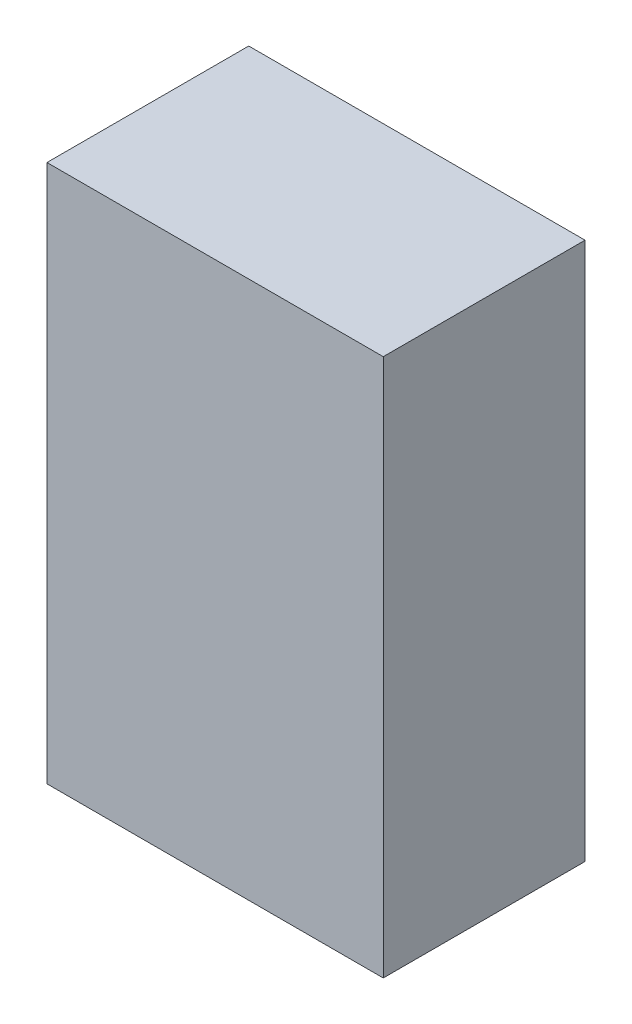
ISO-10303-21;
HEADER;
FILE_DESCRIPTION(('STEP AP214'),'2;1');
FILE_NAME('part.step','',(''),(''),'','','');
FILE_SCHEMA(('AUTOMOTIVE_DESIGN { 1 0 10303 214 1 1 1 1 }'));
ENDSEC;
DATA;
#1=APPLICATION_CONTEXT('core data for automotive mechanical design processes');
#2=APPLICATION_PROTOCOL_DEFINITION('international standard','automotive_design',2000,#1);
#3=PRODUCT_CONTEXT('',#1,'mechanical');
#4=PRODUCT('Part','Part','',(#3));
#5=PRODUCT_RELATED_PRODUCT_CATEGORY('part','',(#4));
#6=PRODUCT_DEFINITION_FORMATION('','',#4);
#7=PRODUCT_DEFINITION_CONTEXT('part definition',#1,'design');
#8=PRODUCT_DEFINITION('design','',#6,#7);
#9=PRODUCT_DEFINITION_SHAPE('','',#8);
#10=(LENGTH_UNIT() NAMED_UNIT(*) SI_UNIT(.MILLI.,.METRE.));
#11=(NAMED_UNIT(*) PLANE_ANGLE_UNIT() SI_UNIT($,.RADIAN.));
#12=(NAMED_UNIT(*) SI_UNIT($,.STERADIAN.) SOLID_ANGLE_UNIT());
#13=UNCERTAINTY_MEASURE_WITH_UNIT(LENGTH_MEASURE(1.E-05),#10,'distance_accuracy_value','');
#14=(GEOMETRIC_REPRESENTATION_CONTEXT(3) GLOBAL_UNCERTAINTY_ASSIGNED_CONTEXT((#13)) GLOBAL_UNIT_ASSIGNED_CONTEXT((#10,
#11,#12)) REPRESENTATION_CONTEXT('',''));
#15=CARTESIAN_POINT('',(0.,0.,0.));
#16=DIRECTION('',(0.,0.,1.));
#17=DIRECTION('',(1.,0.,0.));
#18=AXIS2_PLACEMENT_3D('',#15,#16,#17);
#19=CARTESIAN_POINT('',(2.5,4.,1.5));
#20=DIRECTION('',(-1.,0.,0.));
#21=DIRECTION('',(0.,-1.,0.));
#22=AXIS2_PLACEMENT_3D('',#19,#20,#21);
#23=PLANE('',#22);
#24=DIRECTION('',(0.,1.,0.));
#25=VECTOR('',#24,1.);
#26=CARTESIAN_POINT('',(2.5,4.,-1.5));
#27=LINE('',#26,#25);
#28=CARTESIAN_POINT('',(2.5,-4.,-1.5));
#29=VERTEX_POINT('',#28);
#30=CARTESIAN_POINT('',(2.5,4.,-1.5));
#31=VERTEX_POINT('',#30);
#32=EDGE_CURVE('E96',#29,#31,#27,.T.);
#33=ORIENTED_EDGE('',*,*,#32,.T.);
#34=DIRECTION('',(0.,0.,-1.));
#35=VECTOR('',#34,1.);
#36=CARTESIAN_POINT('',(2.5,4.,1.5));
#37=LINE('',#36,#35);
#38=CARTESIAN_POINT('',(2.5,4.,1.5));
#39=VERTEX_POINT('',#38);
#40=EDGE_CURVE('E11',#39,#31,#37,.T.);
#41=ORIENTED_EDGE('',*,*,#40,.F.);
#42=DIRECTION('',(0.,1.,0.));
#43=VECTOR('',#42,1.);
#44=CARTESIAN_POINT('',(2.5,4.,1.5));
#45=LINE('',#44,#43);
#46=CARTESIAN_POINT('',(2.5,-4.,1.5));
#47=VERTEX_POINT('',#46);
#48=EDGE_CURVE('E84',#47,#39,#45,.T.);
#49=ORIENTED_EDGE('',*,*,#48,.F.);
#50=DIRECTION('',(0.,0.,-1.));
#51=VECTOR('',#50,1.);
#52=CARTESIAN_POINT('',(2.5,-4.,1.5));
#53=LINE('',#52,#51);
#54=EDGE_CURVE('E92',#47,#29,#53,.T.);
#55=ORIENTED_EDGE('',*,*,#54,.T.);
#56=EDGE_LOOP('',(#33,#41,#49,#55));
#57=FACE_BOUND('',#56,.T.);
#58=ADVANCED_FACE('F33',(#57),#23,.F.);
#59=CARTESIAN_POINT('',(-2.5,4.,1.5));
#60=DIRECTION('',(0.,-1.,0.));
#61=DIRECTION('',(0.,0.,-1.));
#62=AXIS2_PLACEMENT_3D('',#59,#60,#61);
#63=PLANE('',#62);
#64=DIRECTION('',(-1.,0.,0.));
#65=VECTOR('',#64,1.);
#66=CARTESIAN_POINT('',(-2.5,4.,-1.5));
#67=LINE('',#66,#65);
#68=CARTESIAN_POINT('',(-2.5,4.,-1.5));
#69=VERTEX_POINT('',#68);
#70=EDGE_CURVE('E88',#31,#69,#67,.T.);
#71=ORIENTED_EDGE('',*,*,#70,.T.);
#72=DIRECTION('',(0.,0.,-1.));
#73=VECTOR('',#72,1.);
#74=CARTESIAN_POINT('',(-2.5,4.,1.5));
#75=LINE('',#74,#73);
#76=CARTESIAN_POINT('',(-2.5,4.,1.5));
#77=VERTEX_POINT('',#76);
#78=EDGE_CURVE('E41',#77,#69,#75,.T.);
#79=ORIENTED_EDGE('',*,*,#78,.F.);
#80=DIRECTION('',(-1.,0.,0.));
#81=VECTOR('',#80,1.);
#82=CARTESIAN_POINT('',(-2.5,4.,1.5));
#83=LINE('',#82,#81);
#84=EDGE_CURVE('E79',#39,#77,#83,.T.);
#85=ORIENTED_EDGE('',*,*,#84,.F.);
#86=ORIENTED_EDGE('',*,*,#40,.T.);
#87=EDGE_LOOP('',(#71,#79,#85,#86));
#88=FACE_BOUND('',#87,.T.);
#89=ADVANCED_FACE('F87',(#88),#63,.F.);
#90=CARTESIAN_POINT('',(-2.5,4.,1.5));
#91=DIRECTION('',(1.,0.,0.));
#92=DIRECTION('',(0.,1.,0.));
#93=AXIS2_PLACEMENT_3D('',#90,#91,#92);
#94=PLANE('',#93);
#95=DIRECTION('',(0.,-1.,0.));
#96=VECTOR('',#95,1.);
#97=CARTESIAN_POINT('',(-2.5,4.,-1.5));
#98=LINE('',#97,#96);
#99=CARTESIAN_POINT('',(-2.5,-4.,-1.5));
#100=VERTEX_POINT('',#99);
#101=EDGE_CURVE('E66',#69,#100,#98,.T.);
#102=ORIENTED_EDGE('',*,*,#101,.T.);
#103=DIRECTION('',(0.,0.,-1.));
#104=VECTOR('',#103,1.);
#105=CARTESIAN_POINT('',(-2.5,-4.,1.5));
#106=LINE('',#105,#104);
#107=CARTESIAN_POINT('',(-2.5,-4.,1.5));
#108=VERTEX_POINT('',#107);
#109=EDGE_CURVE('E89',#108,#100,#106,.T.);
#110=ORIENTED_EDGE('',*,*,#109,.F.);
#111=DIRECTION('',(0.,-1.,0.));
#112=VECTOR('',#111,1.);
#113=CARTESIAN_POINT('',(-2.5,4.,1.5));
#114=LINE('',#113,#112);
#115=EDGE_CURVE('E82',#77,#108,#114,.T.);
#116=ORIENTED_EDGE('',*,*,#115,.F.);
#117=ORIENTED_EDGE('',*,*,#78,.T.);
#118=EDGE_LOOP('',(#102,#110,#116,#117));
#119=FACE_BOUND('',#118,.T.);
#120=ADVANCED_FACE('F90',(#119),#94,.F.);
#121=CARTESIAN_POINT('',(-2.5,-4.,1.5));
#122=DIRECTION('',(0.,1.,0.));
#123=DIRECTION('',(0.,0.,1.));
#124=AXIS2_PLACEMENT_3D('',#121,#122,#123);
#125=PLANE('',#124);
#126=DIRECTION('',(1.,0.,0.));
#127=VECTOR('',#126,1.);
#128=CARTESIAN_POINT('',(-2.5,-4.,-1.5));
#129=LINE('',#128,#127);
#130=EDGE_CURVE('E72',#100,#29,#129,.T.);
#131=ORIENTED_EDGE('',*,*,#130,.T.);
#132=ORIENTED_EDGE('',*,*,#54,.F.);
#133=DIRECTION('',(1.,0.,0.));
#134=VECTOR('',#133,1.);
#135=CARTESIAN_POINT('',(-2.5,-4.,1.5));
#136=LINE('',#135,#134);
#137=EDGE_CURVE('E49',#108,#47,#136,.T.);
#138=ORIENTED_EDGE('',*,*,#137,.F.);
#139=ORIENTED_EDGE('',*,*,#109,.T.);
#140=EDGE_LOOP('',(#131,#132,#138,#139));
#141=FACE_BOUND('',#140,.T.);
#142=ADVANCED_FACE('F103',(#141),#125,.F.);
#143=CARTESIAN_POINT('',(0.,0.,1.5));
#144=DIRECTION('',(0.,0.,1.));
#145=DIRECTION('',(1.,0.,0.));
#146=AXIS2_PLACEMENT_3D('',#143,#144,#145);
#147=PLANE('',#146);
#148=ORIENTED_EDGE('',*,*,#48,.T.);
#149=ORIENTED_EDGE('',*,*,#84,.T.);
#150=ORIENTED_EDGE('',*,*,#115,.T.);
#151=ORIENTED_EDGE('',*,*,#137,.T.);
#152=EDGE_LOOP('',(#148,#149,#150,#151));
#153=FACE_BOUND('',#152,.T.);
#154=ADVANCED_FACE('F80',(#153),#147,.T.);
#155=CARTESIAN_POINT('',(0.,0.,-1.5));
#156=DIRECTION('',(0.,0.,1.));
#157=DIRECTION('',(1.,0.,0.));
#158=AXIS2_PLACEMENT_3D('',#155,#156,#157);
#159=PLANE('',#158);
#160=ORIENTED_EDGE('',*,*,#32,.F.);
#161=ORIENTED_EDGE('',*,*,#130,.F.);
#162=ORIENTED_EDGE('',*,*,#101,.F.);
#163=ORIENTED_EDGE('',*,*,#70,.F.);
#164=EDGE_LOOP('',(#160,#161,#162,#163));
#165=FACE_BOUND('',#164,.T.);
#166=ADVANCED_FACE('F106',(#165),#159,.F.);
#167=CLOSED_SHELL('',(#58,#89,#120,#142,#154,#166));
#168=MANIFOLD_SOLID_BREP('B2',#167);
#169=ADVANCED_BREP_SHAPE_REPRESENTATION('',(#18,#168),#14);
#170=SHAPE_DEFINITION_REPRESENTATION(#9,#169);
ENDSEC;
END-ISO-10303-21;
